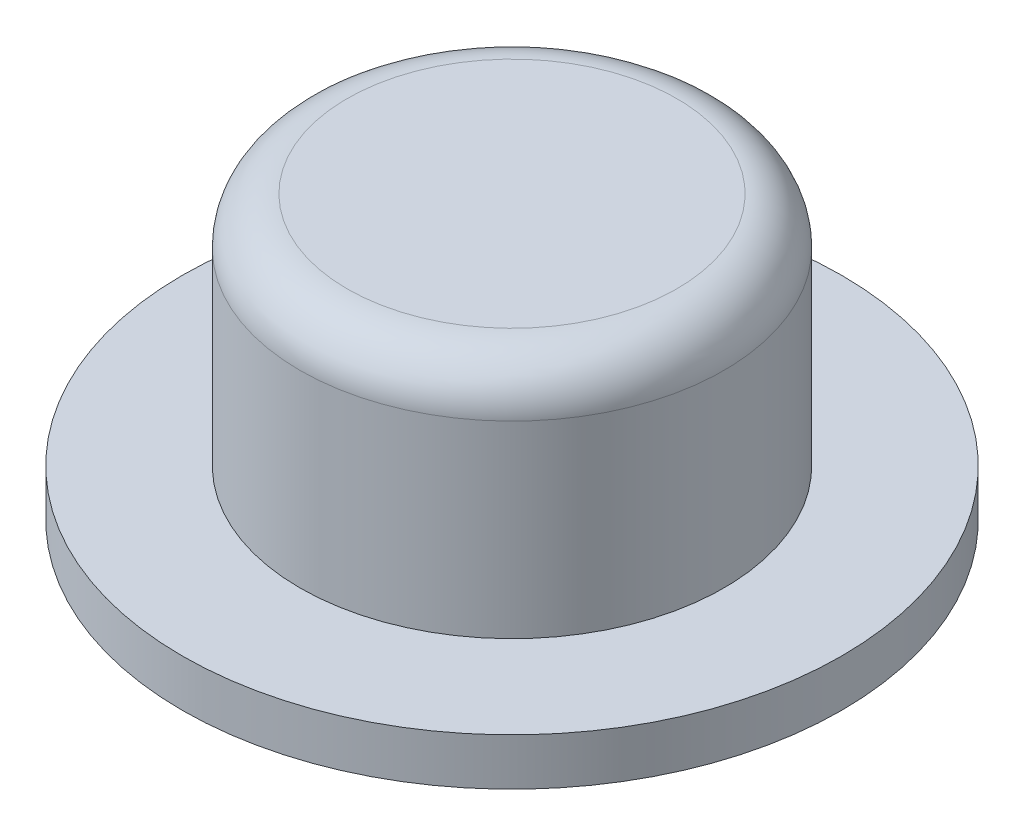
ISO-10303-21;
HEADER;
FILE_DESCRIPTION(('STEP AP214'),'2;1');
FILE_NAME('part.step','',(''),(''),'','','');
FILE_SCHEMA(('AUTOMOTIVE_DESIGN { 1 0 10303 214 1 1 1 1 }'));
ENDSEC;
DATA;
#1=APPLICATION_CONTEXT('core data for automotive mechanical design processes');
#2=APPLICATION_PROTOCOL_DEFINITION('international standard','automotive_design',2000,#1);
#3=PRODUCT_CONTEXT('',#1,'mechanical');
#4=PRODUCT('Part','Part','',(#3));
#5=PRODUCT_RELATED_PRODUCT_CATEGORY('part','',(#4));
#6=PRODUCT_DEFINITION_FORMATION('','',#4);
#7=PRODUCT_DEFINITION_CONTEXT('part definition',#1,'design');
#8=PRODUCT_DEFINITION('design','',#6,#7);
#9=PRODUCT_DEFINITION_SHAPE('','',#8);
#10=(LENGTH_UNIT() NAMED_UNIT(*) SI_UNIT(.MILLI.,.METRE.));
#11=(NAMED_UNIT(*) PLANE_ANGLE_UNIT() SI_UNIT($,.RADIAN.));
#12=(NAMED_UNIT(*) SI_UNIT($,.STERADIAN.) SOLID_ANGLE_UNIT());
#13=UNCERTAINTY_MEASURE_WITH_UNIT(LENGTH_MEASURE(1.E-05),#10,'distance_accuracy_value','');
#14=(GEOMETRIC_REPRESENTATION_CONTEXT(3) GLOBAL_UNCERTAINTY_ASSIGNED_CONTEXT((#13)) GLOBAL_UNIT_ASSIGNED_CONTEXT((#10,
#11,#12)) REPRESENTATION_CONTEXT('',''));
#15=CARTESIAN_POINT('',(0.,0.,0.));
#16=DIRECTION('',(0.,0.,1.));
#17=DIRECTION('',(1.,0.,0.));
#18=AXIS2_PLACEMENT_3D('',#15,#16,#17);
#19=CARTESIAN_POINT('',(-3.49999999999999,6.,0.));
#20=DIRECTION('',(0.,1.,0.));
#21=DIRECTION('',(0.,0.,1.));
#22=AXIS2_PLACEMENT_3D('',#19,#20,#21);
#23=PLANE('',#22);
#24=CARTESIAN_POINT('',(0.,6.,0.));
#25=DIRECTION('',(0.,1.,0.));
#26=DIRECTION('',(0.,0.,1.));
#27=AXIS2_PLACEMENT_3D('',#24,#25,#26);
#28=CIRCLE('',#27,3.49999999999999);
#29=CARTESIAN_POINT('',(0.,6.,3.49999999999999));
#30=VERTEX_POINT('',#29);
#31=EDGE_CURVE('E50',#30,#30,#28,.T.);
#32=ORIENTED_EDGE('',*,*,#31,.T.);
#33=EDGE_LOOP('',(#32));
#34=FACE_BOUND('',#33,.T.);
#35=ADVANCED_FACE('F31',(#34),#23,.T.);
#36=CARTESIAN_POINT('',(0.,0.,0.));
#37=DIRECTION('',(0.,-1.,0.));
#38=DIRECTION('',(0.,0.,-1.));
#39=AXIS2_PLACEMENT_3D('',#36,#37,#38);
#40=PLANE('',#39);
#41=CARTESIAN_POINT('',(0.,0.,0.));
#42=DIRECTION('',(0.,1.,0.));
#43=DIRECTION('',(0.,0.,1.));
#44=AXIS2_PLACEMENT_3D('',#41,#42,#43);
#45=CIRCLE('',#44,7.);
#46=CARTESIAN_POINT('',(0.,0.,7.));
#47=VERTEX_POINT('',#46);
#48=EDGE_CURVE('E10',#47,#47,#45,.T.);
#49=ORIENTED_EDGE('',*,*,#48,.F.);
#50=EDGE_LOOP('',(#49));
#51=FACE_BOUND('',#50,.T.);
#52=ADVANCED_FACE('F67',(#51),#40,.T.);
#53=CARTESIAN_POINT('',(0.,6.,0.));
#54=DIRECTION('',(0.,1.,0.));
#55=DIRECTION('',(0.,0.,1.));
#56=AXIS2_PLACEMENT_3D('',#53,#54,#55);
#57=CYLINDRICAL_SURFACE('',#56,7.);
#58=ORIENTED_EDGE('',*,*,#48,.T.);
#59=EDGE_LOOP('',(#58));
#60=FACE_BOUND('',#59,.T.);
#61=CARTESIAN_POINT('',(0.,0.999999999999999,0.));
#62=DIRECTION('',(0.,1.,0.));
#63=DIRECTION('',(0.,0.,1.));
#64=AXIS2_PLACEMENT_3D('',#61,#62,#63);
#65=CIRCLE('',#64,7.);
#66=CARTESIAN_POINT('',(0.,0.999999999999999,7.));
#67=VERTEX_POINT('',#66);
#68=EDGE_CURVE('E37',#67,#67,#65,.T.);
#69=ORIENTED_EDGE('',*,*,#68,.F.);
#70=EDGE_LOOP('',(#69));
#71=FACE_BOUND('',#70,.T.);
#72=ADVANCED_FACE('F71',(#60,#71),#57,.T.);
#73=CARTESIAN_POINT('',(-7.,0.999999999999999,0.));
#74=DIRECTION('',(0.,1.,0.));
#75=DIRECTION('',(0.,0.,1.));
#76=AXIS2_PLACEMENT_3D('',#73,#74,#75);
#77=PLANE('',#76);
#78=ORIENTED_EDGE('',*,*,#68,.T.);
#79=EDGE_LOOP('',(#78));
#80=FACE_BOUND('',#79,.T.);
#81=CARTESIAN_POINT('',(0.,0.999999999999999,0.));
#82=DIRECTION('',(0.,1.,0.));
#83=DIRECTION('',(0.,0.,1.));
#84=AXIS2_PLACEMENT_3D('',#81,#82,#83);
#85=CIRCLE('',#84,4.5);
#86=CARTESIAN_POINT('',(0.,0.999999999999999,4.5));
#87=VERTEX_POINT('',#86);
#88=EDGE_CURVE('E41',#87,#87,#85,.T.);
#89=ORIENTED_EDGE('',*,*,#88,.F.);
#90=EDGE_LOOP('',(#89));
#91=FACE_BOUND('',#90,.T.);
#92=ADVANCED_FACE('F63',(#80,#91),#77,.T.);
#93=CARTESIAN_POINT('',(0.,6.,0.));
#94=DIRECTION('',(0.,1.,0.));
#95=DIRECTION('',(0.,0.,1.));
#96=AXIS2_PLACEMENT_3D('',#93,#94,#95);
#97=CYLINDRICAL_SURFACE('',#96,4.5);
#98=ORIENTED_EDGE('',*,*,#88,.T.);
#99=EDGE_LOOP('',(#98));
#100=FACE_BOUND('',#99,.T.);
#101=CARTESIAN_POINT('',(0.,4.99999999999999,0.));
#102=DIRECTION('',(0.,1.,0.));
#103=DIRECTION('',(0.,0.,1.));
#104=AXIS2_PLACEMENT_3D('',#101,#102,#103);
#105=CIRCLE('',#104,4.5);
#106=CARTESIAN_POINT('',(0.,4.99999999999999,4.5));
#107=VERTEX_POINT('',#106);
#108=EDGE_CURVE('E45',#107,#107,#105,.T.);
#109=ORIENTED_EDGE('',*,*,#108,.F.);
#110=EDGE_LOOP('',(#109));
#111=FACE_BOUND('',#110,.T.);
#112=ADVANCED_FACE('F57',(#100,#111),#97,.T.);
#113=CARTESIAN_POINT('',(0.,5.,0.));
#114=DIRECTION('',(0.,1.,0.));
#115=DIRECTION('',(0.,0.,1.));
#116=AXIS2_PLACEMENT_3D('',#113,#114,#115);
#117=TOROIDAL_SURFACE('',#116,3.5,1.);
#118=ORIENTED_EDGE('',*,*,#108,.T.);
#119=EDGE_LOOP('',(#118));
#120=FACE_BOUND('',#119,.T.);
#121=ORIENTED_EDGE('',*,*,#31,.F.);
#122=EDGE_LOOP('',(#121));
#123=FACE_BOUND('',#122,.T.);
#124=ADVANCED_FACE('F55',(#120,#123),#117,.T.);
#125=CLOSED_SHELL('',(#35,#52,#72,#92,#112,#124));
#126=MANIFOLD_SOLID_BREP('B2',#125);
#127=ADVANCED_BREP_SHAPE_REPRESENTATION('',(#18,#126),#14);
#128=SHAPE_DEFINITION_REPRESENTATION(#9,#127);
ENDSEC;
END-ISO-10303-21;
